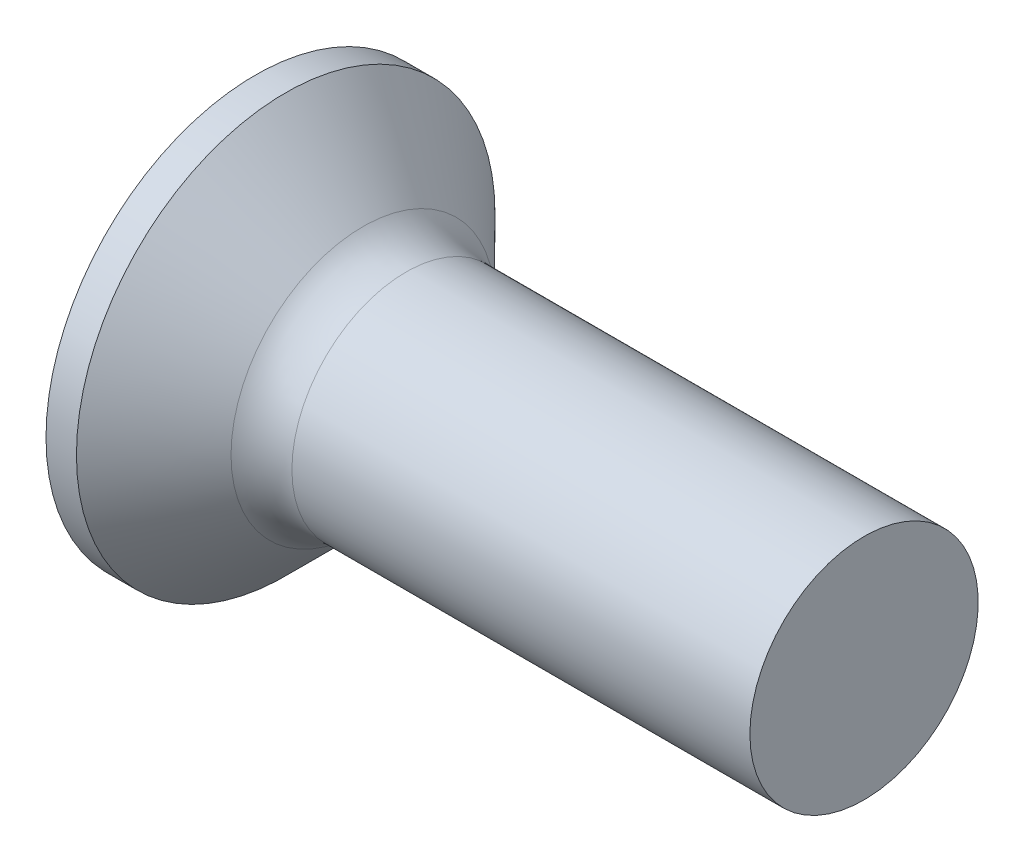
ISO-10303-21;
HEADER;
FILE_DESCRIPTION(('STEP AP214'),'2;1');
FILE_NAME('part.step','',(''),(''),'','','');
FILE_SCHEMA(('AUTOMOTIVE_DESIGN { 1 0 10303 214 1 1 1 1 }'));
ENDSEC;
DATA;
#1=APPLICATION_CONTEXT('core data for automotive mechanical design processes');
#2=APPLICATION_PROTOCOL_DEFINITION('international standard','automotive_design',2000,#1);
#3=PRODUCT_CONTEXT('',#1,'mechanical');
#4=PRODUCT('Part','Part','',(#3));
#5=PRODUCT_RELATED_PRODUCT_CATEGORY('part','',(#4));
#6=PRODUCT_DEFINITION_FORMATION('','',#4);
#7=PRODUCT_DEFINITION_CONTEXT('part definition',#1,'design');
#8=PRODUCT_DEFINITION('design','',#6,#7);
#9=PRODUCT_DEFINITION_SHAPE('','',#8);
#10=(LENGTH_UNIT() NAMED_UNIT(*) SI_UNIT(.MILLI.,.METRE.));
#11=(NAMED_UNIT(*) PLANE_ANGLE_UNIT() SI_UNIT($,.RADIAN.));
#12=(NAMED_UNIT(*) SI_UNIT($,.STERADIAN.) SOLID_ANGLE_UNIT());
#13=UNCERTAINTY_MEASURE_WITH_UNIT(LENGTH_MEASURE(1.E-05),#10,'distance_accuracy_value','');
#14=(GEOMETRIC_REPRESENTATION_CONTEXT(3) GLOBAL_UNCERTAINTY_ASSIGNED_CONTEXT((#13)) GLOBAL_UNIT_ASSIGNED_CONTEXT((#10,
#11,#12)) REPRESENTATION_CONTEXT('',''));
#15=CARTESIAN_POINT('',(0.,0.,0.));
#16=DIRECTION('',(0.,0.,1.));
#17=DIRECTION('',(1.,0.,0.));
#18=AXIS2_PLACEMENT_3D('',#15,#16,#17);
#19=CARTESIAN_POINT('',(2.01,-0.497851135403458,0.37));
#20=DIRECTION('',(0.,0.,-1.));
#21=DIRECTION('',(0.,1.,0.));
#22=AXIS2_PLACEMENT_3D('',#19,#20,#21);
#23=PLANE('',#22);
#24=DIRECTION('',(0.,-1.,0.));
#25=VECTOR('',#24,1.);
#26=CARTESIAN_POINT('',(0.,1.5,0.37));
#27=LINE('',#26,#25);
#28=CARTESIAN_POINT('',(0.,-0.590157547916263,0.37));
#29=VERTEX_POINT('',#28);
#30=CARTESIAN_POINT('',(0.,-1.5,0.37));
#31=VERTEX_POINT('',#30);
#32=EDGE_CURVE('E457',#29,#31,#27,.T.);
#33=ORIENTED_EDGE('',*,*,#32,.F.);
#34=CARTESIAN_POINT('',(-1.01053649699026,-0.672102030078459,0.37));
#35=CARTESIAN_POINT('',(-0.799706058781647,-0.65526709888962,0.37));
#36=CARTESIAN_POINT('',(-0.588886212565099,-0.638297110577309,0.37));
#37=CARTESIAN_POINT('',(-0.167272662573759,-0.603984130523453,0.37));
#38=CARTESIAN_POINT('',(0.0435210405937218,-0.586641131327184,0.37));
#39=CARTESIAN_POINT('',(0.465068838236453,-0.551479911668094,0.37));
#40=CARTESIAN_POINT('',(0.675822932725248,-0.533661691368078,0.37));
#41=CARTESIAN_POINT('',(1.09727362087867,-0.497387538868943,0.37));
#42=CARTESIAN_POINT('',(1.30797021528206,-0.478931615293404,0.37));
#43=CARTESIAN_POINT('',(1.67418894765493,-0.446067164114376,0.37));
#44=CARTESIAN_POINT('',(1.82972932594025,-0.431862501020785,0.37));
#45=CARTESIAN_POINT('',(2.14074770367772,-0.402797709732015,0.37));
#46=CARTESIAN_POINT('',(2.29622570364503,-0.38793758706717,0.37));
#47=CARTESIAN_POINT('',(2.60710169356699,-0.357305117929346,0.37));
#48=CARTESIAN_POINT('',(2.76249967848536,-0.341532719782115,0.37));
#49=CARTESIAN_POINT('',(2.99549070750468,-0.316847908272697,0.37));
#50=CARTESIAN_POINT('',(3.07313791127142,-0.308448465888148,0.37));
#51=CARTESIAN_POINT('',(3.22838341584044,-0.291202251038989,0.37));
#52=CARTESIAN_POINT('',(3.30598171607669,-0.282355473489553,0.37));
#53=CARTESIAN_POINT('',(3.38354828471668,-0.273232461280215,0.37));
#54=B_SPLINE_CURVE_WITH_KNOTS('',3,(#34,#35,#36,#37,#38,#39,#40,#41,#42,#43,#44,#45,#46,#47,#48,
#49,#50,#51,#52,#53),.UNSPECIFIED.,.F.,.F.,(4,2,2,2,2,2,2,2,2,4),(0.,0.634504777580944,
1.26902224771403,1.90353950046914,2.53804817608336,3.00661008454961,3.47516804035678,
3.94375256285268,4.17805198347564,4.41235406796206),.UNSPECIFIED.);
#55=CARTESIAN_POINT('',(2.01,-0.415013252800437,0.37));
#56=VERTEX_POINT('',#55);
#57=EDGE_CURVE('E213',#29,#56,#54,.T.);
#58=ORIENTED_EDGE('',*,*,#57,.T.);
#59=DIRECTION('',(0.,-1.,0.));
#60=VECTOR('',#59,1.);
#61=CARTESIAN_POINT('',(2.01,0.497851135403459,0.37));
#62=LINE('',#61,#60);
#63=CARTESIAN_POINT('',(2.01,-0.497851135403458,0.37));
#64=VERTEX_POINT('',#63);
#65=EDGE_CURVE('E366',#56,#64,#62,.T.);
#66=ORIENTED_EDGE('',*,*,#65,.T.);
#67=DIRECTION('',(0.894934391398442,0.446197753347436,0.));
#68=VECTOR('',#67,1.);
#69=CARTESIAN_POINT('',(0.,-1.5,0.37));
#70=LINE('',#69,#68);
#71=EDGE_CURVE('E465',#31,#64,#70,.T.);
#72=ORIENTED_EDGE('',*,*,#71,.F.);
#73=EDGE_LOOP('',(#33,#58,#66,#72));
#74=FACE_BOUND('',#73,.T.);
#75=ADVANCED_FACE('F34',(#74),#23,.T.);
#76=CARTESIAN_POINT('',(2.01,0.497851135403459,0.37));
#77=VERTEX_POINT('',#76);
#78=CARTESIAN_POINT('',(2.01,0.415013252800437,0.37));
#79=VERTEX_POINT('',#78);
#80=EDGE_CURVE('E362',#77,#79,#62,.T.);
#81=ORIENTED_EDGE('',*,*,#80,.T.);
#82=CARTESIAN_POINT('',(-1.01053649691082,0.672102030072118,0.37));
#83=CARTESIAN_POINT('',(-0.79970605871103,0.655267098883947,0.37));
#84=CARTESIAN_POINT('',(-0.588886212503304,0.638297110572311,0.37));
#85=CARTESIAN_POINT('',(-0.16727266252961,0.603984130519828,0.37));
#86=CARTESIAN_POINT('',(0.0435210406290475,0.586641131324258,0.37));
#87=CARTESIAN_POINT('',(0.465068838244709,0.551479911667385,0.37));
#88=CARTESIAN_POINT('',(0.67582293271526,0.533661691368909,0.37));
#89=CARTESIAN_POINT('',(1.09727362083221,0.497387538872971,0.37));
#90=CARTESIAN_POINT('',(1.30797021521736,0.478931615299089,0.37));
#91=CARTESIAN_POINT('',(1.67418894757201,0.446067164121905,0.37));
#92=CARTESIAN_POINT('',(1.82972932585734,0.431862501028414,0.37));
#93=CARTESIAN_POINT('',(2.14074770359484,0.402797709739879,0.37));
#94=CARTESIAN_POINT('',(2.29622570356215,0.38793758707517,0.37));
#95=CARTESIAN_POINT('',(2.60710169348415,0.357305117937676,0.37));
#96=CARTESIAN_POINT('',(2.76249967840253,0.34153271979064,0.37));
#97=CARTESIAN_POINT('',(2.99549070742189,0.316847908281594,0.37));
#98=CARTESIAN_POINT('',(3.07313791118864,0.308448465897182,0.37));
#99=CARTESIAN_POINT('',(3.22838341575769,0.291202251048339,0.37));
#100=CARTESIAN_POINT('',(3.30598171599396,0.282355473499082,0.37));
#101=CARTESIAN_POINT('',(3.38354828463398,0.27323246128995,0.37));
#102=B_SPLINE_CURVE_WITH_KNOTS('',3,(#82,#83,#84,#85,#86,#87,#88,#89,#90,#91,#92,#93,#94,#95,
#96,#97,#98,#99,#100,#101),.UNSPECIFIED.,.F.,.F.,(4,2,2,2,2,2,2,2,2,4),(0.,0.634504777554397,
1.26902224766093,1.90353950036111,2.53804817592041,3.00661008438666,3.47516804019383,
3.94375256268972,4.17805198331267,4.41235406779909),.UNSPECIFIED.);
#103=CARTESIAN_POINT('',(0.,0.590157547916263,0.37));
#104=VERTEX_POINT('',#103);
#105=EDGE_CURVE('E206',#79,#104,#102,.F.);
#106=ORIENTED_EDGE('',*,*,#105,.T.);
#107=CARTESIAN_POINT('',(0.,1.5,0.37));
#108=VERTEX_POINT('',#107);
#109=EDGE_CURVE('E459',#108,#104,#27,.T.);
#110=ORIENTED_EDGE('',*,*,#109,.F.);
#111=DIRECTION('',(0.894934391398442,-0.446197753347436,0.));
#112=VECTOR('',#111,1.);
#113=CARTESIAN_POINT('',(0.,1.5,0.37));
#114=LINE('',#113,#112);
#115=EDGE_CURVE('E57',#108,#77,#114,.T.);
#116=ORIENTED_EDGE('',*,*,#115,.T.);
#117=EDGE_LOOP('',(#81,#106,#110,#116));
#118=FACE_BOUND('',#117,.T.);
#119=ADVANCED_FACE('F188',(#118),#23,.T.);
#120=CARTESIAN_POINT('',(2.01,0.497851135403458,-0.37));
#121=DIRECTION('',(0.,0.,1.));
#122=DIRECTION('',(1.,0.,0.));
#123=AXIS2_PLACEMENT_3D('',#120,#121,#122);
#124=PLANE('',#123);
#125=DIRECTION('',(0.,1.,0.));
#126=VECTOR('',#125,1.);
#127=CARTESIAN_POINT('',(2.01,-0.497851135403458,-0.37));
#128=LINE('',#127,#126);
#129=CARTESIAN_POINT('',(2.01,-0.497851135403458,-0.37));
#130=VERTEX_POINT('',#129);
#131=CARTESIAN_POINT('',(2.01,-0.415013252800437,-0.37));
#132=VERTEX_POINT('',#131);
#133=EDGE_CURVE('E375',#130,#132,#128,.T.);
#134=ORIENTED_EDGE('',*,*,#133,.T.);
#135=CARTESIAN_POINT('',(-1.01053649699026,-0.672102030078459,-0.369999999999999));
#136=CARTESIAN_POINT('',(-0.799706058781648,-0.65526709888962,-0.369999999999999));
#137=CARTESIAN_POINT('',(-0.588886212565099,-0.63829711057731,-0.369999999999999));
#138=CARTESIAN_POINT('',(-0.167272662573758,-0.603984130523453,-0.37));
#139=CARTESIAN_POINT('',(0.043521040593722,-0.586641131327185,-0.37));
#140=CARTESIAN_POINT('',(0.465068838236453,-0.551479911668094,-0.37));
#141=CARTESIAN_POINT('',(0.675822932725248,-0.533661691368078,-0.37));
#142=CARTESIAN_POINT('',(1.09727362087867,-0.497387538868943,-0.37));
#143=CARTESIAN_POINT('',(1.30797021528206,-0.478931615293404,-0.37));
#144=CARTESIAN_POINT('',(1.67418894765493,-0.446067164114376,-0.37));
#145=CARTESIAN_POINT('',(1.82972932594025,-0.431862501020785,-0.37));
#146=CARTESIAN_POINT('',(2.14074770367772,-0.402797709732015,-0.37));
#147=CARTESIAN_POINT('',(2.29622570364503,-0.38793758706717,-0.37));
#148=CARTESIAN_POINT('',(2.60710169356699,-0.357305117929346,-0.37));
#149=CARTESIAN_POINT('',(2.76249967848536,-0.341532719782115,-0.37));
#150=CARTESIAN_POINT('',(2.99549070750468,-0.316847908272697,-0.37));
#151=CARTESIAN_POINT('',(3.07313791127142,-0.308448465888148,-0.37));
#152=CARTESIAN_POINT('',(3.22838341584044,-0.291202251038989,-0.37));
#153=CARTESIAN_POINT('',(3.30598171607669,-0.282355473489553,-0.37));
#154=CARTESIAN_POINT('',(3.38354828471668,-0.273232461280215,-0.37));
#155=B_SPLINE_CURVE_WITH_KNOTS('',3,(#135,#136,#137,#138,#139,#140,#141,#142,#143,#144,#145,
#146,#147,#148,#149,#150,#151,#152,#153,#154),.UNSPECIFIED.,.F.,.F.,(4,2,2,2,2,2,2,2,2,4),(0.,
0.634504777580944,1.26902224771403,1.90353950046914,2.53804817608336,3.00661008454961,
3.47516804035678,3.94375256285268,4.17805198347564,4.41235406796206),.UNSPECIFIED.);
#156=CARTESIAN_POINT('',(0.,-0.590157547916263,-0.37));
#157=VERTEX_POINT('',#156);
#158=EDGE_CURVE('E269',#132,#157,#155,.F.);
#159=ORIENTED_EDGE('',*,*,#158,.T.);
#160=DIRECTION('',(0.,1.,0.));
#161=VECTOR('',#160,1.);
#162=CARTESIAN_POINT('',(0.,-1.5,-0.37));
#163=LINE('',#162,#161);
#164=CARTESIAN_POINT('',(0.,-1.5,-0.37));
#165=VERTEX_POINT('',#164);
#166=EDGE_CURVE('E458',#165,#157,#163,.T.);
#167=ORIENTED_EDGE('',*,*,#166,.F.);
#168=DIRECTION('',(0.894934391398442,0.446197753347436,0.));
#169=VECTOR('',#168,1.);
#170=CARTESIAN_POINT('',(0.,-1.5,-0.37));
#171=LINE('',#170,#169);
#172=EDGE_CURVE('E468',#165,#130,#171,.T.);
#173=ORIENTED_EDGE('',*,*,#172,.T.);
#174=EDGE_LOOP('',(#134,#159,#167,#173));
#175=FACE_BOUND('',#174,.T.);
#176=ADVANCED_FACE('F194',(#175),#124,.T.);
#177=CARTESIAN_POINT('',(0.,0.590157547916263,-0.37));
#178=VERTEX_POINT('',#177);
#179=CARTESIAN_POINT('',(0.,1.5,-0.37));
#180=VERTEX_POINT('',#179);
#181=EDGE_CURVE('E464',#178,#180,#163,.T.);
#182=ORIENTED_EDGE('',*,*,#181,.F.);
#183=CARTESIAN_POINT('',(-1.01053649699026,0.672102030078459,-0.369999999999999));
#184=CARTESIAN_POINT('',(-0.799706058781648,0.65526709888962,-0.369999999999999));
#185=CARTESIAN_POINT('',(-0.588886212565099,0.63829711057731,-0.369999999999999));
#186=CARTESIAN_POINT('',(-0.167272662573758,0.603984130523453,-0.37));
#187=CARTESIAN_POINT('',(0.0435210405937222,0.586641131327185,-0.37));
#188=CARTESIAN_POINT('',(0.465068838236453,0.551479911668094,-0.37));
#189=CARTESIAN_POINT('',(0.675822932725248,0.533661691368078,-0.37));
#190=CARTESIAN_POINT('',(1.09727362087867,0.497387538868943,-0.37));
#191=CARTESIAN_POINT('',(1.30797021528206,0.478931615293404,-0.37));
#192=CARTESIAN_POINT('',(1.67418894765493,0.446067164114376,-0.37));
#193=CARTESIAN_POINT('',(1.82972932594025,0.431862501020785,-0.37));
#194=CARTESIAN_POINT('',(2.14074770367772,0.402797709732015,-0.37));
#195=CARTESIAN_POINT('',(2.29622570364503,0.38793758706717,-0.37));
#196=CARTESIAN_POINT('',(2.60710169356699,0.357305117929346,-0.37));
#197=CARTESIAN_POINT('',(2.76249967848536,0.341532719782115,-0.37));
#198=CARTESIAN_POINT('',(2.99549070750468,0.316847908272698,-0.37));
#199=CARTESIAN_POINT('',(3.07313791127142,0.308448465888148,-0.37));
#200=CARTESIAN_POINT('',(3.22838341584044,0.291202251038989,-0.37));
#201=CARTESIAN_POINT('',(3.30598171607669,0.282355473489553,-0.37));
#202=CARTESIAN_POINT('',(3.38354828471668,0.273232461280215,-0.37));
#203=B_SPLINE_CURVE_WITH_KNOTS('',3,(#183,#184,#185,#186,#187,#188,#189,#190,#191,#192,#193,
#194,#195,#196,#197,#198,#199,#200,#201,#202),.UNSPECIFIED.,.F.,.F.,(4,2,2,2,2,2,2,2,2,4),(0.,
0.634504777580944,1.26902224771403,1.90353950046914,2.53804817608336,3.00661008454961,
3.47516804035678,3.94375256285268,4.17805198347564,4.41235406796206),.UNSPECIFIED.);
#204=CARTESIAN_POINT('',(2.01,0.415013252800437,-0.37));
#205=VERTEX_POINT('',#204);
#206=EDGE_CURVE('E263',#178,#205,#203,.T.);
#207=ORIENTED_EDGE('',*,*,#206,.T.);
#208=CARTESIAN_POINT('',(2.01,0.497851135403459,-0.37));
#209=VERTEX_POINT('',#208);
#210=EDGE_CURVE('E377',#205,#209,#128,.T.);
#211=ORIENTED_EDGE('',*,*,#210,.T.);
#212=DIRECTION('',(0.894934391398442,-0.446197753347436,0.));
#213=VECTOR('',#212,1.);
#214=CARTESIAN_POINT('',(0.,1.5,-0.37));
#215=LINE('',#214,#213);
#216=EDGE_CURVE('E374',#180,#209,#215,.T.);
#217=ORIENTED_EDGE('',*,*,#216,.F.);
#218=EDGE_LOOP('',(#182,#207,#211,#217));
#219=FACE_BOUND('',#218,.T.);
#220=ADVANCED_FACE('F475',(#219),#124,.T.);
#221=CARTESIAN_POINT('',(2.01,0.497851135403459,-0.37));
#222=DIRECTION('',(1.,0.,0.));
#223=DIRECTION('',(0.,0.,-1.));
#224=AXIS2_PLACEMENT_3D('',#221,#222,#223);
#225=PLANE('',#224);
#226=CARTESIAN_POINT('',(2.01,0.,0.));
#227=DIRECTION('',(-1.,0.,0.));
#228=DIRECTION('',(0.,0.,1.));
#229=AXIS2_PLACEMENT_3D('',#226,#227,#228);
#230=CIRCLE('',#229,0.555999999999999);
#231=CARTESIAN_POINT('',(2.01,-0.24754847399547,-0.497851135403459));
#232=VERTEX_POINT('',#231);
#233=CARTESIAN_POINT('',(2.01,-0.369999999999999,-0.415013252800438));
#234=VERTEX_POINT('',#233);
#235=EDGE_CURVE('E341',#232,#234,#230,.T.);
#236=ORIENTED_EDGE('',*,*,#235,.F.);
#237=DIRECTION('',(0.,1.,0.));
#238=VECTOR('',#237,1.);
#239=CARTESIAN_POINT('',(2.01,-0.369999999999998,-0.49785113540346));
#240=LINE('',#239,#238);
#241=CARTESIAN_POINT('',(2.01,-0.369999999999998,-0.49785113540346));
#242=VERTEX_POINT('',#241);
#243=EDGE_CURVE('E442',#242,#232,#240,.T.);
#244=ORIENTED_EDGE('',*,*,#243,.F.);
#245=DIRECTION('',(0.,0.,-1.));
#246=VECTOR('',#245,1.);
#247=CARTESIAN_POINT('',(2.01,-0.370000000000002,0.497851135403457));
#248=LINE('',#247,#246);
#249=EDGE_CURVE('E446',#234,#242,#248,.T.);
#250=ORIENTED_EDGE('',*,*,#249,.F.);
#251=EDGE_LOOP('',(#236,#244,#250));
#252=FACE_BOUND('',#251,.T.);
#253=ADVANCED_FACE('F488',(#252),#225,.F.);
#254=CARTESIAN_POINT('',(2.01,-0.497851135403458,-0.247548473995471));
#255=VERTEX_POINT('',#254);
#256=EDGE_CURVE('E336',#132,#255,#230,.T.);
#257=ORIENTED_EDGE('',*,*,#256,.F.);
#258=ORIENTED_EDGE('',*,*,#133,.F.);
#259=DIRECTION('',(0.,0.,-1.));
#260=VECTOR('',#259,1.);
#261=CARTESIAN_POINT('',(2.01,-0.497851135403458,0.37));
#262=LINE('',#261,#260);
#263=EDGE_CURVE('E365',#255,#130,#262,.T.);
#264=ORIENTED_EDGE('',*,*,#263,.F.);
#265=EDGE_LOOP('',(#257,#258,#264));
#266=FACE_BOUND('',#265,.T.);
#267=ADVANCED_FACE('F494',(#266),#225,.F.);
#268=CARTESIAN_POINT('',(2.01,-0.497851135403458,0.247548473995471));
#269=VERTEX_POINT('',#268);
#270=EDGE_CURVE('E331',#269,#56,#230,.T.);
#271=ORIENTED_EDGE('',*,*,#270,.F.);
#272=EDGE_CURVE('E368',#64,#269,#262,.T.);
#273=ORIENTED_EDGE('',*,*,#272,.F.);
#274=ORIENTED_EDGE('',*,*,#65,.F.);
#275=EDGE_LOOP('',(#271,#273,#274));
#276=FACE_BOUND('',#275,.T.);
#277=ADVANCED_FACE('F500',(#276),#225,.F.);
#278=CARTESIAN_POINT('',(2.01,-0.370000000000001,0.415013252800435));
#279=VERTEX_POINT('',#278);
#280=CARTESIAN_POINT('',(2.01,-0.247548473995473,0.497851135403458));
#281=VERTEX_POINT('',#280);
#282=EDGE_CURVE('E49',#279,#281,#230,.T.);
#283=ORIENTED_EDGE('',*,*,#282,.F.);
#284=CARTESIAN_POINT('',(2.01,-0.370000000000002,0.497851135403457));
#285=VERTEX_POINT('',#284);
#286=EDGE_CURVE('E448',#285,#279,#248,.T.);
#287=ORIENTED_EDGE('',*,*,#286,.F.);
#288=DIRECTION('',(0.,-1.,0.));
#289=VECTOR('',#288,1.);
#290=CARTESIAN_POINT('',(2.01,0.369999999999998,0.49785113540346));
#291=LINE('',#290,#289);
#292=EDGE_CURVE('E447',#281,#285,#291,.T.);
#293=ORIENTED_EDGE('',*,*,#292,.F.);
#294=EDGE_LOOP('',(#283,#287,#293));
#295=FACE_BOUND('',#294,.T.);
#296=ADVANCED_FACE('F527',(#295),#225,.F.);
#297=CARTESIAN_POINT('',(2.01,0.247548473995469,0.497851135403459));
#298=VERTEX_POINT('',#297);
#299=CARTESIAN_POINT('',(2.01,0.369999999999999,0.415013252800438));
#300=VERTEX_POINT('',#299);
#301=EDGE_CURVE('E322',#298,#300,#230,.T.);
#302=ORIENTED_EDGE('',*,*,#301,.F.);
#303=CARTESIAN_POINT('',(2.01,0.369999999999998,0.49785113540346));
#304=VERTEX_POINT('',#303);
#305=EDGE_CURVE('E443',#304,#298,#291,.T.);
#306=ORIENTED_EDGE('',*,*,#305,.F.);
#307=DIRECTION('',(0.,0.,1.));
#308=VECTOR('',#307,1.);
#309=CARTESIAN_POINT('',(2.01,0.370000000000002,-0.497851135403457));
#310=LINE('',#309,#308);
#311=EDGE_CURVE('E220',#300,#304,#310,.T.);
#312=ORIENTED_EDGE('',*,*,#311,.F.);
#313=EDGE_LOOP('',(#302,#306,#312));
#314=FACE_BOUND('',#313,.T.);
#315=ADVANCED_FACE('F484',(#314),#225,.F.);
#316=CARTESIAN_POINT('',(2.01,0.497851135403459,0.247548473995471));
#317=VERTEX_POINT('',#316);
#318=EDGE_CURVE('E329',#79,#317,#230,.T.);
#319=ORIENTED_EDGE('',*,*,#318,.F.);
#320=ORIENTED_EDGE('',*,*,#80,.F.);
#321=DIRECTION('',(0.,0.,1.));
#322=VECTOR('',#321,1.);
#323=CARTESIAN_POINT('',(2.01,0.497851135403459,-0.37));
#324=LINE('',#323,#322);
#325=EDGE_CURVE('E363',#317,#77,#324,.T.);
#326=ORIENTED_EDGE('',*,*,#325,.F.);
#327=EDGE_LOOP('',(#319,#320,#326));
#328=FACE_BOUND('',#327,.T.);
#329=ADVANCED_FACE('F361',(#328),#225,.F.);
#330=CARTESIAN_POINT('',(2.01,0.497851135403459,-0.247548473995471));
#331=VERTEX_POINT('',#330);
#332=EDGE_CURVE('E351',#331,#205,#230,.T.);
#333=ORIENTED_EDGE('',*,*,#332,.F.);
#334=EDGE_CURVE('E370',#209,#331,#324,.T.);
#335=ORIENTED_EDGE('',*,*,#334,.F.);
#336=ORIENTED_EDGE('',*,*,#210,.F.);
#337=EDGE_LOOP('',(#333,#335,#336));
#338=FACE_BOUND('',#337,.T.);
#339=ADVANCED_FACE('F477',(#338),#225,.F.);
#340=CARTESIAN_POINT('',(0.,-1.5,-0.369999999999999));
#341=DIRECTION('',(-0.446197753347436,0.894934391398443,0.));
#342=DIRECTION('',(-0.894934391398443,-0.446197753347436,0.));
#343=AXIS2_PLACEMENT_3D('',#340,#341,#342);
#344=PLANE('',#343);
#345=ORIENTED_EDGE('',*,*,#272,.T.);
#346=CARTESIAN_POINT('',(2.86902919914418,-0.0695550475538966,0.));
#347=DIRECTION('',(-0.446197753347436,0.894934391398443,0.));
#348=DIRECTION('',(-0.894934391398443,-0.446197753347436,0.));
#349=AXIS2_PLACEMENT_3D('',#346,#347,#348);
#350=ELLIPSE('',#349,1.11145971268776,0.491029001453358);
#351=EDGE_CURVE('E281',#269,#255,#350,.F.);
#352=ORIENTED_EDGE('',*,*,#351,.T.);
#353=ORIENTED_EDGE('',*,*,#263,.T.);
#354=ORIENTED_EDGE('',*,*,#172,.F.);
#355=DIRECTION('',(0.,0.,-1.));
#356=VECTOR('',#355,1.);
#357=CARTESIAN_POINT('',(0.,-1.5,0.37));
#358=LINE('',#357,#356);
#359=EDGE_CURVE('E382',#31,#165,#358,.T.);
#360=ORIENTED_EDGE('',*,*,#359,.F.);
#361=ORIENTED_EDGE('',*,*,#71,.T.);
#362=EDGE_LOOP('',(#345,#352,#353,#354,#360,#361));
#363=FACE_BOUND('',#362,.T.);
#364=ADVANCED_FACE('F200',(#363),#344,.T.);
#365=CARTESIAN_POINT('',(2.01,0.497851135403459,0.37));
#366=DIRECTION('',(-0.446197753347436,-0.894934391398443,0.));
#367=DIRECTION('',(0.894934391398442,-0.446197753347436,0.));
#368=AXIS2_PLACEMENT_3D('',#365,#366,#367);
#369=PLANE('',#368);
#370=ORIENTED_EDGE('',*,*,#334,.T.);
#371=CARTESIAN_POINT('',(2.86902919914418,0.0695550475538964,0.));
#372=DIRECTION('',(-0.446197753347436,-0.894934391398443,0.));
#373=DIRECTION('',(-0.894934391398443,0.446197753347436,0.));
#374=AXIS2_PLACEMENT_3D('',#371,#372,#373);
#375=ELLIPSE('',#374,1.11145971268776,0.491029001453358);
#376=EDGE_CURVE('E286',#331,#317,#375,.F.);
#377=ORIENTED_EDGE('',*,*,#376,.T.);
#378=ORIENTED_EDGE('',*,*,#325,.T.);
#379=ORIENTED_EDGE('',*,*,#115,.F.);
#380=DIRECTION('',(0.,0.,1.));
#381=VECTOR('',#380,1.);
#382=CARTESIAN_POINT('',(0.,1.5,-0.37));
#383=LINE('',#382,#381);
#384=EDGE_CURVE('E454',#180,#108,#383,.T.);
#385=ORIENTED_EDGE('',*,*,#384,.F.);
#386=ORIENTED_EDGE('',*,*,#216,.T.);
#387=EDGE_LOOP('',(#370,#377,#378,#379,#385,#386));
#388=FACE_BOUND('',#387,.T.);
#389=ADVANCED_FACE('F473',(#388),#369,.T.);
#390=CARTESIAN_POINT('',(2.01,0.369999999999998,0.49785113540346));
#391=DIRECTION('',(0.,-1.,0.));
#392=DIRECTION('',(1.,0.,0.));
#393=AXIS2_PLACEMENT_3D('',#390,#391,#392);
#394=PLANE('',#393);
#395=CARTESIAN_POINT('',(2.01,0.370000000000002,-0.497851135403457));
#396=VERTEX_POINT('',#395);
#397=CARTESIAN_POINT('',(2.01,0.370000000000001,-0.415013252800435));
#398=VERTEX_POINT('',#397);
#399=EDGE_CURVE('E452',#396,#398,#310,.T.);
#400=ORIENTED_EDGE('',*,*,#399,.T.);
#401=CARTESIAN_POINT('',(-1.01053649699026,0.370000000000002,-0.672102030078458));
#402=CARTESIAN_POINT('',(-0.799706058781647,0.370000000000002,-0.655267098889619));
#403=CARTESIAN_POINT('',(-0.588886212565098,0.370000000000002,-0.638297110577308));
#404=CARTESIAN_POINT('',(-0.167272662573759,0.370000000000002,-0.603984130523451));
#405=CARTESIAN_POINT('',(0.0435210405937221,0.370000000000002,-0.586641131327183));
#406=CARTESIAN_POINT('',(0.465068838236453,0.370000000000002,-0.551479911668093));
#407=CARTESIAN_POINT('',(0.675822932725248,0.370000000000002,-0.533661691368077));
#408=CARTESIAN_POINT('',(1.09727362087867,0.370000000000001,-0.497387538868942));
#409=CARTESIAN_POINT('',(1.30797021528206,0.370000000000001,-0.478931615293402));
#410=CARTESIAN_POINT('',(1.67418894765493,0.370000000000001,-0.446067164114374));
#411=CARTESIAN_POINT('',(1.82972932594025,0.370000000000001,-0.431862501020784));
#412=CARTESIAN_POINT('',(2.14074770367772,0.370000000000001,-0.402797709732014));
#413=CARTESIAN_POINT('',(2.29622570364503,0.370000000000001,-0.387937587067168));
#414=CARTESIAN_POINT('',(2.60710169356699,0.370000000000001,-0.357305117929344));
#415=CARTESIAN_POINT('',(2.76249967848536,0.370000000000001,-0.341532719782114));
#416=CARTESIAN_POINT('',(2.99549070750468,0.370000000000001,-0.316847908272696));
#417=CARTESIAN_POINT('',(3.07313791127142,0.370000000000001,-0.308448465888146));
#418=CARTESIAN_POINT('',(3.22838341584044,0.370000000000001,-0.291202251038987));
#419=CARTESIAN_POINT('',(3.30598171607669,0.370000000000001,-0.282355473489552));
#420=CARTESIAN_POINT('',(3.38354828471668,0.370000000000001,-0.273232461280213));
#421=B_SPLINE_CURVE_WITH_KNOTS('',3,(#401,#402,#403,#404,#405,#406,#407,#408,#409,#410,#411,
#412,#413,#414,#415,#416,#417,#418,#419,#420),.UNSPECIFIED.,.F.,.F.,(4,2,2,2,2,2,2,2,2,4),(0.,
0.634504777580944,1.26902224771403,1.90353950046914,2.53804817608336,3.00661008454961,
3.47516804035678,3.94375256285268,4.17805198347564,4.41235406796206),.UNSPECIFIED.);
#422=CARTESIAN_POINT('',(0.,0.370000000000002,-0.590157547916262));
#423=VERTEX_POINT('',#422);
#424=EDGE_CURVE('E255',#398,#423,#421,.F.);
#425=ORIENTED_EDGE('',*,*,#424,.T.);
#426=DIRECTION('',(0.,0.,1.));
#427=VECTOR('',#426,1.);
#428=CARTESIAN_POINT('',(0.,0.370000000000005,-1.5));
#429=LINE('',#428,#427);
#430=CARTESIAN_POINT('',(0.,0.370000000000005,-1.5));
#431=VERTEX_POINT('',#430);
#432=EDGE_CURVE('E428',#431,#423,#429,.T.);
#433=ORIENTED_EDGE('',*,*,#432,.F.);
#434=DIRECTION('',(0.894934391398442,0.,0.446197753347436));
#435=VECTOR('',#434,1.);
#436=CARTESIAN_POINT('',(0.,0.370000000000005,-1.5));
#437=LINE('',#436,#435);
#438=EDGE_CURVE('E434',#431,#396,#437,.T.);
#439=ORIENTED_EDGE('',*,*,#438,.T.);
#440=EDGE_LOOP('',(#400,#425,#433,#439));
#441=FACE_BOUND('',#440,.T.);
#442=ADVANCED_FACE('F607',(#441),#394,.T.);
#443=CARTESIAN_POINT('',(2.01,-0.369999999999998,-0.497851135403459));
#444=DIRECTION('',(0.,1.,0.));
#445=DIRECTION('',(0.,0.,1.));
#446=AXIS2_PLACEMENT_3D('',#443,#444,#445);
#447=PLANE('',#446);
#448=DIRECTION('',(0.,0.,-1.));
#449=VECTOR('',#448,1.);
#450=CARTESIAN_POINT('',(0.,-0.370000000000005,1.5));
#451=LINE('',#450,#449);
#452=CARTESIAN_POINT('',(0.,-0.369999999999998,-0.590157547916264));
#453=VERTEX_POINT('',#452);
#454=CARTESIAN_POINT('',(0.,-0.369999999999995,-1.5));
#455=VERTEX_POINT('',#454);
#456=EDGE_CURVE('E424',#453,#455,#451,.T.);
#457=ORIENTED_EDGE('',*,*,#456,.F.);
#458=CARTESIAN_POINT('',(-1.01053649691082,-0.369999999999998,-0.672102030072119));
#459=CARTESIAN_POINT('',(-0.79970605871103,-0.369999999999998,-0.655267098883948));
#460=CARTESIAN_POINT('',(-0.588886212503304,-0.369999999999998,-0.638297110572312));
#461=CARTESIAN_POINT('',(-0.16727266252961,-0.369999999999998,-0.603984130519829));
#462=CARTESIAN_POINT('',(0.0435210406290474,-0.369999999999998,-0.58664113132426));
#463=CARTESIAN_POINT('',(0.465068838244709,-0.369999999999998,-0.551479911667386));
#464=CARTESIAN_POINT('',(0.67582293271526,-0.369999999999998,-0.53366169136891));
#465=CARTESIAN_POINT('',(1.09727362083221,-0.369999999999998,-0.497387538872972));
#466=CARTESIAN_POINT('',(1.30797021521736,-0.369999999999998,-0.47893161529909));
#467=CARTESIAN_POINT('',(1.67418894757201,-0.369999999999999,-0.446067164121906));
#468=CARTESIAN_POINT('',(1.82972932585734,-0.369999999999999,-0.431862501028415));
#469=CARTESIAN_POINT('',(2.14074770359484,-0.369999999999999,-0.402797709739881));
#470=CARTESIAN_POINT('',(2.29622570356215,-0.369999999999999,-0.387937587075171));
#471=CARTESIAN_POINT('',(2.60710169348415,-0.369999999999999,-0.357305117937677));
#472=CARTESIAN_POINT('',(2.76249967840253,-0.369999999999999,-0.341532719790641));
#473=CARTESIAN_POINT('',(2.99549070742189,-0.369999999999999,-0.316847908281595));
#474=CARTESIAN_POINT('',(3.07313791118864,-0.369999999999999,-0.308448465897183));
#475=CARTESIAN_POINT('',(3.22838341575769,-0.369999999999999,-0.29120225104834));
#476=CARTESIAN_POINT('',(3.30598171599396,-0.369999999999999,-0.282355473499083));
#477=CARTESIAN_POINT('',(3.38354828463398,-0.369999999999999,-0.273232461289951));
#478=B_SPLINE_CURVE_WITH_KNOTS('',3,(#458,#459,#460,#461,#462,#463,#464,#465,#466,#467,#468,
#469,#470,#471,#472,#473,#474,#475,#476,#477),.UNSPECIFIED.,.F.,.F.,(4,2,2,2,2,2,2,2,2,4),(0.,
0.634504777554397,1.26902224766093,1.90353950036111,2.53804817592041,3.00661008438666,
3.47516804019383,3.94375256268972,4.17805198331267,4.41235406779909),.UNSPECIFIED.);
#479=EDGE_CURVE('E248',#453,#234,#478,.T.);
#480=ORIENTED_EDGE('',*,*,#479,.T.);
#481=ORIENTED_EDGE('',*,*,#249,.T.);
#482=DIRECTION('',(0.894934391398442,0.,0.446197753347436));
#483=VECTOR('',#482,1.);
#484=CARTESIAN_POINT('',(0.,-0.369999999999995,-1.5));
#485=LINE('',#484,#483);
#486=EDGE_CURVE('E431',#455,#242,#485,.T.);
#487=ORIENTED_EDGE('',*,*,#486,.F.);
#488=EDGE_LOOP('',(#457,#480,#481,#487));
#489=FACE_BOUND('',#488,.T.);
#490=ADVANCED_FACE('F505',(#489),#447,.T.);
#491=CARTESIAN_POINT('',(0.,0.370000000000005,-1.5));
#492=DIRECTION('',(-0.446197753347436,0.,0.894934391398443));
#493=DIRECTION('',(-0.894934391398443,0.,-0.446197753347436));
#494=AXIS2_PLACEMENT_3D('',#491,#492,#493);
#495=PLANE('',#494);
#496=ORIENTED_EDGE('',*,*,#243,.T.);
#497=CARTESIAN_POINT('',(2.86902919914418,0.,-0.0695550475538966));
#498=DIRECTION('',(-0.446197753347436,0.,0.894934391398443));
#499=DIRECTION('',(-0.894934391398443,0.,-0.446197753347436));
#500=AXIS2_PLACEMENT_3D('',#497,#498,#499);
#501=ELLIPSE('',#500,1.11145971268776,0.491029001453358);
#502=CARTESIAN_POINT('',(2.01,0.247548473995473,-0.497851135403457));
#503=VERTEX_POINT('',#502);
#504=EDGE_CURVE('E299',#232,#503,#501,.F.);
#505=ORIENTED_EDGE('',*,*,#504,.T.);
#506=EDGE_CURVE('E450',#503,#396,#240,.T.);
#507=ORIENTED_EDGE('',*,*,#506,.T.);
#508=ORIENTED_EDGE('',*,*,#438,.F.);
#509=DIRECTION('',(0.,1.,0.));
#510=VECTOR('',#509,1.);
#511=CARTESIAN_POINT('',(0.,-0.369999999999995,-1.5));
#512=LINE('',#511,#510);
#513=EDGE_CURVE('E423',#455,#431,#512,.T.);
#514=ORIENTED_EDGE('',*,*,#513,.F.);
#515=ORIENTED_EDGE('',*,*,#486,.T.);
#516=EDGE_LOOP('',(#496,#505,#507,#508,#514,#515));
#517=FACE_BOUND('',#516,.T.);
#518=ADVANCED_FACE('F225',(#517),#495,.T.);
#519=ORIENTED_EDGE('',*,*,#286,.T.);
#520=CARTESIAN_POINT('',(-1.01053649699026,-0.370000000000002,0.672102030078458));
#521=CARTESIAN_POINT('',(-0.799706058781648,-0.370000000000002,0.655267098889619));
#522=CARTESIAN_POINT('',(-0.588886212565099,-0.370000000000002,0.638297110577308));
#523=CARTESIAN_POINT('',(-0.167272662573759,-0.370000000000002,0.603984130523451));
#524=CARTESIAN_POINT('',(0.0435210405937217,-0.370000000000002,0.586641131327183));
#525=CARTESIAN_POINT('',(0.465068838236452,-0.370000000000002,0.551479911668093));
#526=CARTESIAN_POINT('',(0.675822932725247,-0.370000000000002,0.533661691368077));
#527=CARTESIAN_POINT('',(1.09727362087867,-0.370000000000002,0.497387538868941));
#528=CARTESIAN_POINT('',(1.30797021528206,-0.370000000000002,0.478931615293402));
#529=CARTESIAN_POINT('',(1.67418894765493,-0.370000000000002,0.446067164114374));
#530=CARTESIAN_POINT('',(1.82972932594025,-0.370000000000002,0.431862501020784));
#531=CARTESIAN_POINT('',(2.14074770367772,-0.370000000000001,0.402797709732014));
#532=CARTESIAN_POINT('',(2.29622570364503,-0.370000000000001,0.387937587067169));
#533=CARTESIAN_POINT('',(2.60710169356699,-0.370000000000001,0.357305117929345));
#534=CARTESIAN_POINT('',(2.76249967848536,-0.370000000000001,0.341532719782114));
#535=CARTESIAN_POINT('',(2.99549070750468,-0.370000000000001,0.316847908272696));
#536=CARTESIAN_POINT('',(3.07313791127142,-0.370000000000001,0.308448465888146));
#537=CARTESIAN_POINT('',(3.22838341584044,-0.370000000000001,0.291202251038987));
#538=CARTESIAN_POINT('',(3.30598171607669,-0.370000000000001,0.282355473489552));
#539=CARTESIAN_POINT('',(3.38354828471668,-0.370000000000001,0.273232461280214));
#540=B_SPLINE_CURVE_WITH_KNOTS('',3,(#520,#521,#522,#523,#524,#525,#526,#527,#528,#529,#530,
#531,#532,#533,#534,#535,#536,#537,#538,#539),.UNSPECIFIED.,.F.,.F.,(4,2,2,2,2,2,2,2,2,4),(0.,
0.634504777580944,1.26902224771403,1.90353950046914,2.53804817608336,3.00661008454961,
3.47516804035678,3.94375256285268,4.17805198347564,4.41235406796206),.UNSPECIFIED.);
#541=CARTESIAN_POINT('',(0.,-0.370000000000002,0.590157547916262));
#542=VERTEX_POINT('',#541);
#543=EDGE_CURVE('E240',#279,#542,#540,.F.);
#544=ORIENTED_EDGE('',*,*,#543,.T.);
#545=CARTESIAN_POINT('',(0.,-0.370000000000005,1.5));
#546=VERTEX_POINT('',#545);
#547=EDGE_CURVE('E419',#546,#542,#451,.T.);
#548=ORIENTED_EDGE('',*,*,#547,.F.);
#549=DIRECTION('',(0.894934391398442,0.,-0.446197753347436));
#550=VECTOR('',#549,1.);
#551=CARTESIAN_POINT('',(0.,-0.370000000000005,1.5));
#552=LINE('',#551,#550);
#553=EDGE_CURVE('E437',#546,#285,#552,.T.);
#554=ORIENTED_EDGE('',*,*,#553,.T.);
#555=EDGE_LOOP('',(#519,#544,#548,#554));
#556=FACE_BOUND('',#555,.T.);
#557=ADVANCED_FACE('F525',(#556),#447,.T.);
#558=CARTESIAN_POINT('',(0.,0.369999999999998,0.590157547916264));
#559=VERTEX_POINT('',#558);
#560=CARTESIAN_POINT('',(0.,0.369999999999994,1.5));
#561=VERTEX_POINT('',#560);
#562=EDGE_CURVE('E430',#559,#561,#429,.T.);
#563=ORIENTED_EDGE('',*,*,#562,.F.);
#564=CARTESIAN_POINT('',(-1.01053649691082,0.369999999999997,0.672102030072119));
#565=CARTESIAN_POINT('',(-0.79970605871103,0.369999999999997,0.655267098883949));
#566=CARTESIAN_POINT('',(-0.588886212503304,0.369999999999997,0.638297110572313));
#567=CARTESIAN_POINT('',(-0.16727266252961,0.369999999999997,0.603984130519829));
#568=CARTESIAN_POINT('',(0.0435210406290476,0.369999999999998,0.58664113132426));
#569=CARTESIAN_POINT('',(0.465068838244709,0.369999999999998,0.551479911667386));
#570=CARTESIAN_POINT('',(0.67582293271526,0.369999999999998,0.53366169136891));
#571=CARTESIAN_POINT('',(1.09727362083221,0.369999999999998,0.497387538872972));
#572=CARTESIAN_POINT('',(1.30797021521736,0.369999999999998,0.478931615299091));
#573=CARTESIAN_POINT('',(1.67418894757201,0.369999999999998,0.446067164121907));
#574=CARTESIAN_POINT('',(1.82972932585734,0.369999999999998,0.431862501028415));
#575=CARTESIAN_POINT('',(2.14074770359484,0.369999999999999,0.402797709739881));
#576=CARTESIAN_POINT('',(2.29622570356215,0.369999999999999,0.387937587075171));
#577=CARTESIAN_POINT('',(2.60710169348415,0.369999999999999,0.357305117937677));
#578=CARTESIAN_POINT('',(2.76249967840253,0.369999999999999,0.341532719790641));
#579=CARTESIAN_POINT('',(2.99549070742189,0.369999999999999,0.316847908281595));
#580=CARTESIAN_POINT('',(3.07313791118864,0.369999999999999,0.308448465897183));
#581=CARTESIAN_POINT('',(3.22838341575769,0.369999999999999,0.29120225104834));
#582=CARTESIAN_POINT('',(3.30598171599396,0.369999999999999,0.282355473499083));
#583=CARTESIAN_POINT('',(3.38354828463398,0.369999999999999,0.273232461289951));
#584=B_SPLINE_CURVE_WITH_KNOTS('',3,(#564,#565,#566,#567,#568,#569,#570,#571,#572,#573,#574,
#575,#576,#577,#578,#579,#580,#581,#582,#583),.UNSPECIFIED.,.F.,.F.,(4,2,2,2,2,2,2,2,2,4),(0.,
0.634504777554397,1.26902224766093,1.90353950036111,2.53804817592041,3.00661008438666,
3.47516804019383,3.94375256268972,4.17805198331267,4.41235406779909),.UNSPECIFIED.);
#585=EDGE_CURVE('E230',#559,#300,#584,.T.);
#586=ORIENTED_EDGE('',*,*,#585,.T.);
#587=ORIENTED_EDGE('',*,*,#311,.T.);
#588=DIRECTION('',(0.894934391398442,0.,-0.446197753347436));
#589=VECTOR('',#588,1.);
#590=CARTESIAN_POINT('',(0.,0.369999999999994,1.5));
#591=LINE('',#590,#589);
#592=EDGE_CURVE('E439',#561,#304,#591,.T.);
#593=ORIENTED_EDGE('',*,*,#592,.F.);
#594=EDGE_LOOP('',(#563,#586,#587,#593));
#595=FACE_BOUND('',#594,.T.);
#596=ADVANCED_FACE('F520',(#595),#394,.T.);
#597=CARTESIAN_POINT('',(2.01,-0.370000000000002,0.497851135403457));
#598=DIRECTION('',(-0.446197753347436,0.,-0.894934391398443));
#599=DIRECTION('',(0.894934391398442,0.,-0.446197753347436));
#600=AXIS2_PLACEMENT_3D('',#597,#598,#599);
#601=PLANE('',#600);
#602=ORIENTED_EDGE('',*,*,#305,.T.);
#603=CARTESIAN_POINT('',(2.86902919914418,0.,0.0695550475538964));
#604=DIRECTION('',(-0.446197753347436,0.,-0.894934391398443));
#605=DIRECTION('',(-0.894934391398443,0.,0.446197753347436));
#606=AXIS2_PLACEMENT_3D('',#603,#604,#605);
#607=ELLIPSE('',#606,1.11145971268776,0.491029001453358);
#608=EDGE_CURVE('E11',#298,#281,#607,.F.);
#609=ORIENTED_EDGE('',*,*,#608,.T.);
#610=ORIENTED_EDGE('',*,*,#292,.T.);
#611=ORIENTED_EDGE('',*,*,#553,.F.);
#612=DIRECTION('',(0.,-1.,0.));
#613=VECTOR('',#612,1.);
#614=CARTESIAN_POINT('',(0.,0.369999999999994,1.5));
#615=LINE('',#614,#613);
#616=EDGE_CURVE('E221',#561,#546,#615,.T.);
#617=ORIENTED_EDGE('',*,*,#616,.F.);
#618=ORIENTED_EDGE('',*,*,#592,.T.);
#619=EDGE_LOOP('',(#602,#609,#610,#611,#617,#618));
#620=FACE_BOUND('',#619,.T.);
#621=ADVANCED_FACE('F417',(#620),#601,.T.);
#622=CARTESIAN_POINT('',(0.,0.,0.));
#623=DIRECTION('',(-1.,0.,0.));
#624=DIRECTION('',(0.,0.,1.));
#625=AXIS2_PLACEMENT_3D('',#622,#623,#624);
#626=PLANE('',#625);
#627=CARTESIAN_POINT('',(0.,0.,0.));
#628=DIRECTION('',(-1.,0.,0.));
#629=DIRECTION('',(0.,0.,1.));
#630=AXIS2_PLACEMENT_3D('',#627,#628,#629);
#631=CIRCLE('',#630,2.75);
#632=CARTESIAN_POINT('',(0.,0.,2.75));
#633=VERTEX_POINT('',#632);
#634=EDGE_CURVE('E385',#633,#633,#631,.T.);
#635=ORIENTED_EDGE('',*,*,#634,.T.);
#636=EDGE_LOOP('',(#635));
#637=FACE_BOUND('',#636,.T.);
#638=ORIENTED_EDGE('',*,*,#547,.T.);
#639=CARTESIAN_POINT('',(0.,0.,0.));
#640=DIRECTION('',(-1.,0.,0.));
#641=DIRECTION('',(0.,0.,1.));
#642=AXIS2_PLACEMENT_3D('',#639,#640,#641);
#643=CIRCLE('',#642,0.696552892006441);
#644=EDGE_CURVE('E317',#29,#542,#643,.T.);
#645=ORIENTED_EDGE('',*,*,#644,.F.);
#646=ORIENTED_EDGE('',*,*,#32,.T.);
#647=ORIENTED_EDGE('',*,*,#359,.T.);
#648=ORIENTED_EDGE('',*,*,#166,.T.);
#649=EDGE_CURVE('E320',#453,#157,#643,.T.);
#650=ORIENTED_EDGE('',*,*,#649,.F.);
#651=ORIENTED_EDGE('',*,*,#456,.T.);
#652=ORIENTED_EDGE('',*,*,#513,.T.);
#653=ORIENTED_EDGE('',*,*,#432,.T.);
#654=EDGE_CURVE('E316',#178,#423,#643,.T.);
#655=ORIENTED_EDGE('',*,*,#654,.F.);
#656=ORIENTED_EDGE('',*,*,#181,.T.);
#657=ORIENTED_EDGE('',*,*,#384,.T.);
#658=ORIENTED_EDGE('',*,*,#109,.T.);
#659=EDGE_CURVE('E312',#559,#104,#643,.T.);
#660=ORIENTED_EDGE('',*,*,#659,.F.);
#661=ORIENTED_EDGE('',*,*,#562,.T.);
#662=ORIENTED_EDGE('',*,*,#616,.T.);
#663=EDGE_LOOP('',(#638,#645,#646,#647,#648,#650,#651,#652,#653,#655,#656,#657,#658,#660,#661,#662));
#664=FACE_BOUND('',#663,.T.);
#665=ADVANCED_FACE('F411',(#637,#664),#626,.T.);
#666=CARTESIAN_POINT('',(-6.34999999999999,0.,0.));
#667=DIRECTION('',(-1.,0.,0.));
#668=DIRECTION('',(0.,0.,1.));
#669=AXIS2_PLACEMENT_3D('',#666,#667,#668);
#670=CYLINDRICAL_SURFACE('',#669,2.75);
#671=CARTESIAN_POINT('',(0.400000000000006,0.,0.));
#672=DIRECTION('',(-1.,0.,0.));
#673=DIRECTION('',(0.,0.,1.));
#674=AXIS2_PLACEMENT_3D('',#671,#672,#673);
#675=CIRCLE('',#674,2.75);
#676=CARTESIAN_POINT('',(0.400000000000006,0.,2.75));
#677=VERTEX_POINT('',#676);
#678=EDGE_CURVE('E381',#677,#677,#675,.T.);
#679=ORIENTED_EDGE('',*,*,#678,.T.);
#680=EDGE_LOOP('',(#679));
#681=FACE_BOUND('',#680,.T.);
#682=ORIENTED_EDGE('',*,*,#634,.F.);
#683=EDGE_LOOP('',(#682));
#684=FACE_BOUND('',#683,.T.);
#685=ADVANCED_FACE('F405',(#681,#684),#670,.T.);
#686=CARTESIAN_POINT('',(0.400000000000006,0.,0.));
#687=DIRECTION('',(-1.,0.,0.));
#688=DIRECTION('',(0.,0.,1.));
#689=AXIS2_PLACEMENT_3D('',#686,#687,#688);
#690=CONICAL_SURFACE('',#689,2.75,0.785398163397451);
#691=CARTESIAN_POINT('',(1.41568542494924,0.,0.));
#692=DIRECTION('',(-1.,0.,0.));
#693=DIRECTION('',(0.,0.,1.));
#694=AXIS2_PLACEMENT_3D('',#691,#692,#693);
#695=CIRCLE('',#694,1.73431457505076);
#696=CARTESIAN_POINT('',(1.41568542494924,0.,1.73431457505076));
#697=VERTEX_POINT('',#696);
#698=EDGE_CURVE('E388',#697,#697,#695,.T.);
#699=ORIENTED_EDGE('',*,*,#698,.T.);
#700=EDGE_LOOP('',(#699));
#701=FACE_BOUND('',#700,.T.);
#702=ORIENTED_EDGE('',*,*,#678,.F.);
#703=EDGE_LOOP('',(#702));
#704=FACE_BOUND('',#703,.T.);
#705=ADVANCED_FACE('F402',(#701,#704),#690,.T.);
#706=CARTESIAN_POINT('',(-6.34999999999999,0.,0.));
#707=DIRECTION('',(-1.,0.,0.));
#708=DIRECTION('',(0.,0.,1.));
#709=AXIS2_PLACEMENT_3D('',#706,#707,#708);
#710=CYLINDRICAL_SURFACE('',#709,1.5);
#711=CARTESIAN_POINT('',(1.98137084989848,0.,0.));
#712=DIRECTION('',(-1.,0.,0.));
#713=DIRECTION('',(0.,0.,1.));
#714=AXIS2_PLACEMENT_3D('',#711,#712,#713);
#715=CIRCLE('',#714,1.5);
#716=CARTESIAN_POINT('',(1.98137084989848,0.,1.5));
#717=VERTEX_POINT('',#716);
#718=EDGE_CURVE('E42',#717,#717,#715,.F.);
#719=ORIENTED_EDGE('',*,*,#718,.T.);
#720=EDGE_LOOP('',(#719));
#721=FACE_BOUND('',#720,.T.);
#722=CARTESIAN_POINT('',(8.,0.,0.));
#723=DIRECTION('',(-1.,0.,0.));
#724=DIRECTION('',(0.,0.,1.));
#725=AXIS2_PLACEMENT_3D('',#722,#723,#724);
#726=CIRCLE('',#725,1.5);
#727=CARTESIAN_POINT('',(8.,0.,1.5));
#728=VERTEX_POINT('',#727);
#729=EDGE_CURVE('E378',#728,#728,#726,.T.);
#730=ORIENTED_EDGE('',*,*,#729,.T.);
#731=EDGE_LOOP('',(#730));
#732=FACE_BOUND('',#731,.T.);
#733=ADVANCED_FACE('F393',(#721,#732),#710,.T.);
#734=CARTESIAN_POINT('',(8.,1.5,0.));
#735=DIRECTION('',(1.,0.,0.));
#736=DIRECTION('',(0.,0.,-1.));
#737=AXIS2_PLACEMENT_3D('',#734,#735,#736);
#738=PLANE('',#737);
#739=ORIENTED_EDGE('',*,*,#729,.F.);
#740=EDGE_LOOP('',(#739));
#741=FACE_BOUND('',#740,.T.);
#742=ADVANCED_FACE('F399',(#741),#738,.T.);
#743=CARTESIAN_POINT('',(1.98137084989848,0.,0.));
#744=DIRECTION('',(-1.,0.,0.));
#745=DIRECTION('',(0.,0.,1.));
#746=AXIS2_PLACEMENT_3D('',#743,#744,#745);
#747=TOROIDAL_SURFACE('',#746,2.3,0.8);
#748=ORIENTED_EDGE('',*,*,#718,.F.);
#749=EDGE_LOOP('',(#748));
#750=FACE_BOUND('',#749,.T.);
#751=ORIENTED_EDGE('',*,*,#698,.F.);
#752=EDGE_LOOP('',(#751));
#753=FACE_BOUND('',#752,.T.);
#754=ADVANCED_FACE('F36',(#750,#753),#747,.F.);
#755=EDGE_CURVE('E346',#398,#503,#230,.T.);
#756=ORIENTED_EDGE('',*,*,#755,.F.);
#757=ORIENTED_EDGE('',*,*,#399,.F.);
#758=ORIENTED_EDGE('',*,*,#506,.F.);
#759=EDGE_LOOP('',(#756,#757,#758));
#760=FACE_BOUND('',#759,.T.);
#761=ADVANCED_FACE('F398',(#760),#225,.F.);
#762=CARTESIAN_POINT('',(2.01,0.,0.));
#763=DIRECTION('',(-1.,0.,0.));
#764=DIRECTION('',(0.,0.,1.));
#765=AXIS2_PLACEMENT_3D('',#762,#763,#764);
#766=CONICAL_SURFACE('',#765,0.555999999999999,0.069813170079766);
#767=ORIENTED_EDGE('',*,*,#644,.T.);
#768=ORIENTED_EDGE('',*,*,#543,.F.);
#769=EDGE_CURVE('E330',#56,#279,#230,.T.);
#770=ORIENTED_EDGE('',*,*,#769,.F.);
#771=ORIENTED_EDGE('',*,*,#57,.F.);
#772=EDGE_LOOP('',(#767,#768,#770,#771));
#773=FACE_BOUND('',#772,.T.);
#774=ADVANCED_FACE('F185',(#773),#766,.F.);
#775=EDGE_CURVE('E325',#300,#79,#230,.T.);
#776=ORIENTED_EDGE('',*,*,#775,.F.);
#777=ORIENTED_EDGE('',*,*,#585,.F.);
#778=ORIENTED_EDGE('',*,*,#659,.T.);
#779=ORIENTED_EDGE('',*,*,#105,.F.);
#780=EDGE_LOOP('',(#776,#777,#778,#779));
#781=FACE_BOUND('',#780,.T.);
#782=ADVANCED_FACE('F492',(#781),#766,.F.);
#783=EDGE_CURVE('E338',#234,#132,#230,.T.);
#784=ORIENTED_EDGE('',*,*,#783,.F.);
#785=ORIENTED_EDGE('',*,*,#479,.F.);
#786=ORIENTED_EDGE('',*,*,#649,.T.);
#787=ORIENTED_EDGE('',*,*,#158,.F.);
#788=EDGE_LOOP('',(#784,#785,#786,#787));
#789=FACE_BOUND('',#788,.T.);
#790=ADVANCED_FACE('F508',(#789),#766,.F.);
#791=ORIENTED_EDGE('',*,*,#654,.T.);
#792=ORIENTED_EDGE('',*,*,#424,.F.);
#793=EDGE_CURVE('E348',#205,#398,#230,.T.);
#794=ORIENTED_EDGE('',*,*,#793,.F.);
#795=ORIENTED_EDGE('',*,*,#206,.F.);
#796=EDGE_LOOP('',(#791,#792,#794,#795));
#797=FACE_BOUND('',#796,.T.);
#798=ADVANCED_FACE('F510',(#797),#766,.F.);
#799=EDGE_CURVE('E353',#317,#331,#230,.T.);
#800=ORIENTED_EDGE('',*,*,#799,.F.);
#801=ORIENTED_EDGE('',*,*,#376,.F.);
#802=EDGE_LOOP('',(#800,#801));
#803=FACE_BOUND('',#802,.T.);
#804=ADVANCED_FACE('F515',(#803),#766,.F.);
#805=EDGE_CURVE('E333',#255,#269,#230,.T.);
#806=ORIENTED_EDGE('',*,*,#805,.F.);
#807=ORIENTED_EDGE('',*,*,#351,.F.);
#808=EDGE_LOOP('',(#806,#807));
#809=FACE_BOUND('',#808,.T.);
#810=ADVANCED_FACE('F689',(#809),#766,.F.);
#811=EDGE_CURVE('E343',#503,#232,#230,.T.);
#812=ORIENTED_EDGE('',*,*,#811,.F.);
#813=ORIENTED_EDGE('',*,*,#504,.F.);
#814=EDGE_LOOP('',(#812,#813));
#815=FACE_BOUND('',#814,.T.);
#816=ADVANCED_FACE('F182',(#815),#766,.F.);
#817=EDGE_CURVE('E326',#281,#298,#230,.T.);
#818=ORIENTED_EDGE('',*,*,#817,.F.);
#819=ORIENTED_EDGE('',*,*,#608,.F.);
#820=EDGE_LOOP('',(#818,#819));
#821=FACE_BOUND('',#820,.T.);
#822=ADVANCED_FACE('F177',(#821),#766,.F.);
#823=CARTESIAN_POINT('',(2.19065535110549,0.,0.));
#824=DIRECTION('',(-1.,0.,0.));
#825=DIRECTION('',(0.,0.,1.));
#826=AXIS2_PLACEMENT_3D('',#823,#824,#825);
#827=CONICAL_SURFACE('',#826,0.,1.25663706143592);
#828=ORIENTED_EDGE('',*,*,#301,.T.);
#829=ORIENTED_EDGE('',*,*,#775,.T.);
#830=ORIENTED_EDGE('',*,*,#318,.T.);
#831=ORIENTED_EDGE('',*,*,#799,.T.);
#832=ORIENTED_EDGE('',*,*,#332,.T.);
#833=ORIENTED_EDGE('',*,*,#793,.T.);
#834=ORIENTED_EDGE('',*,*,#755,.T.);
#835=ORIENTED_EDGE('',*,*,#811,.T.);
#836=ORIENTED_EDGE('',*,*,#235,.T.);
#837=ORIENTED_EDGE('',*,*,#783,.T.);
#838=ORIENTED_EDGE('',*,*,#256,.T.);
#839=ORIENTED_EDGE('',*,*,#805,.T.);
#840=ORIENTED_EDGE('',*,*,#270,.T.);
#841=ORIENTED_EDGE('',*,*,#769,.T.);
#842=ORIENTED_EDGE('',*,*,#282,.T.);
#843=ORIENTED_EDGE('',*,*,#817,.T.);
#844=EDGE_LOOP('',(#828,#829,#830,#831,#832,#833,#834,#835,#836,#837,#838,#839,#840,#841,#842,#843));
#845=FACE_BOUND('',#844,.T.);
#846=CARTESIAN_POINT('',(2.19065535110549,0.,0.));
#847=VERTEX_POINT('',#846);
#848=VERTEX_LOOP('',#847);
#849=FACE_BOUND('',#848,.T.);
#850=ADVANCED_FACE('F175',(#845,#849),#827,.F.);
#851=CLOSED_SHELL('',(#75,#119,#176,#220,#253,#267,#277,#296,#315,#329,#339,#364,#389,#442,#490,
#518,#557,#596,#621,#665,#685,#705,#733,#742,#754,#761,#774,#782,#790,#798,#804,#810,#816,#822,#850));
#852=MANIFOLD_SOLID_BREP('B2',#851);
#853=ADVANCED_BREP_SHAPE_REPRESENTATION('',(#18,#852),#14);
#854=SHAPE_DEFINITION_REPRESENTATION(#9,#853);
ENDSEC;
END-ISO-10303-21;
